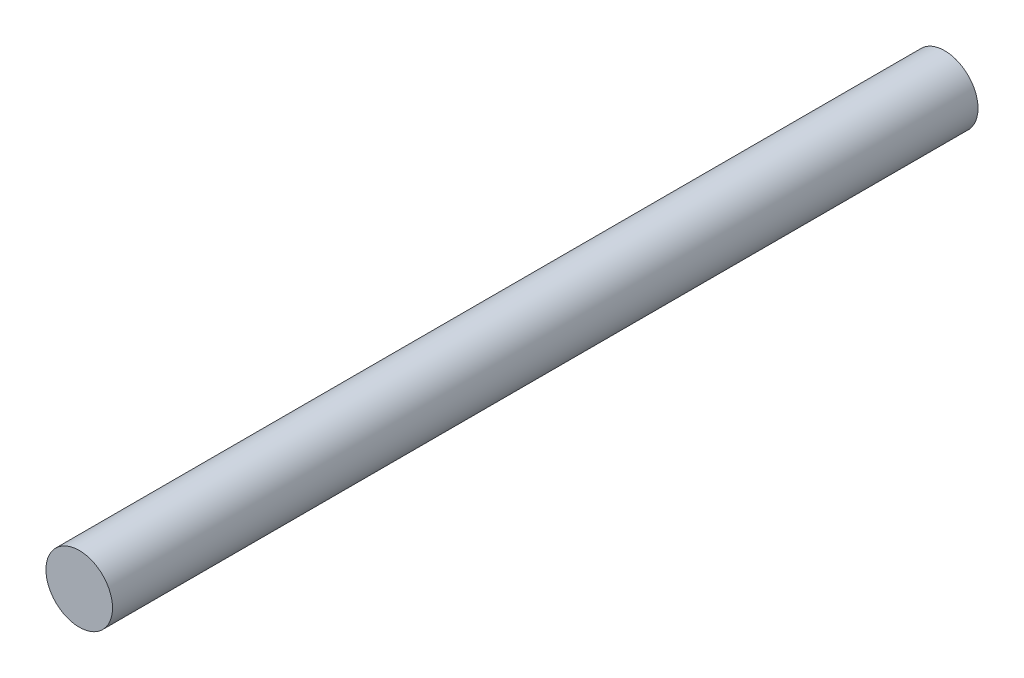
ISO-10303-21;
HEADER;
FILE_DESCRIPTION(('STEP AP214'),'2;1');
FILE_NAME('part.step','',(''),(''),'','','');
FILE_SCHEMA(('AUTOMOTIVE_DESIGN { 1 0 10303 214 1 1 1 1 }'));
ENDSEC;
DATA;
#1=APPLICATION_CONTEXT('core data for automotive mechanical design processes');
#2=APPLICATION_PROTOCOL_DEFINITION('international standard','automotive_design',2000,#1);
#3=PRODUCT_CONTEXT('',#1,'mechanical');
#4=PRODUCT('Part','Part','',(#3));
#5=PRODUCT_RELATED_PRODUCT_CATEGORY('part','',(#4));
#6=PRODUCT_DEFINITION_FORMATION('','',#4);
#7=PRODUCT_DEFINITION_CONTEXT('part definition',#1,'design');
#8=PRODUCT_DEFINITION('design','',#6,#7);
#9=PRODUCT_DEFINITION_SHAPE('','',#8);
#10=(LENGTH_UNIT() NAMED_UNIT(*) SI_UNIT(.MILLI.,.METRE.));
#11=(NAMED_UNIT(*) PLANE_ANGLE_UNIT() SI_UNIT($,.RADIAN.));
#12=(NAMED_UNIT(*) SI_UNIT($,.STERADIAN.) SOLID_ANGLE_UNIT());
#13=UNCERTAINTY_MEASURE_WITH_UNIT(LENGTH_MEASURE(1.E-05),#10,'distance_accuracy_value','');
#14=(GEOMETRIC_REPRESENTATION_CONTEXT(3) GLOBAL_UNCERTAINTY_ASSIGNED_CONTEXT((#13)) GLOBAL_UNIT_ASSIGNED_CONTEXT((#10,
#11,#12)) REPRESENTATION_CONTEXT('',''));
#15=CARTESIAN_POINT('',(0.,0.,0.));
#16=DIRECTION('',(0.,0.,1.));
#17=DIRECTION('',(1.,0.,0.));
#18=AXIS2_PLACEMENT_3D('',#15,#16,#17);
#19=CARTESIAN_POINT('',(0.,0.,165.1));
#20=DIRECTION('',(0.,0.,-1.));
#21=DIRECTION('',(-1.,0.,0.));
#22=AXIS2_PLACEMENT_3D('',#19,#20,#21);
#23=CYLINDRICAL_SURFACE('',#22,6.35);
#24=CARTESIAN_POINT('',(0.,0.,165.1));
#25=DIRECTION('',(0.,0.,1.));
#26=DIRECTION('',(1.,0.,0.));
#27=AXIS2_PLACEMENT_3D('',#24,#25,#26);
#28=CIRCLE('',#27,6.35);
#29=CARTESIAN_POINT('',(6.35,0.,165.1));
#30=VERTEX_POINT('',#29);
#31=EDGE_CURVE('E10',#30,#30,#28,.T.);
#32=ORIENTED_EDGE('',*,*,#31,.F.);
#33=EDGE_LOOP('',(#32));
#34=FACE_BOUND('',#33,.T.);
#35=CARTESIAN_POINT('',(0.,0.,0.));
#36=DIRECTION('',(0.,0.,1.));
#37=DIRECTION('',(1.,0.,0.));
#38=AXIS2_PLACEMENT_3D('',#35,#36,#37);
#39=CIRCLE('',#38,6.35);
#40=CARTESIAN_POINT('',(6.35,0.,0.));
#41=VERTEX_POINT('',#40);
#42=EDGE_CURVE('E33',#41,#41,#39,.T.);
#43=ORIENTED_EDGE('',*,*,#42,.T.);
#44=EDGE_LOOP('',(#43));
#45=FACE_BOUND('',#44,.T.);
#46=ADVANCED_FACE('F30',(#34,#45),#23,.T.);
#47=CARTESIAN_POINT('',(0.,0.,165.1));
#48=DIRECTION('',(0.,0.,1.));
#49=DIRECTION('',(1.,0.,0.));
#50=AXIS2_PLACEMENT_3D('',#47,#48,#49);
#51=PLANE('',#50);
#52=ORIENTED_EDGE('',*,*,#31,.T.);
#53=EDGE_LOOP('',(#52));
#54=FACE_BOUND('',#53,.T.);
#55=ADVANCED_FACE('F45',(#54),#51,.T.);
#56=CARTESIAN_POINT('',(0.,0.,0.));
#57=DIRECTION('',(0.,0.,1.));
#58=DIRECTION('',(1.,0.,0.));
#59=AXIS2_PLACEMENT_3D('',#56,#57,#58);
#60=PLANE('',#59);
#61=ORIENTED_EDGE('',*,*,#42,.F.);
#62=EDGE_LOOP('',(#61));
#63=FACE_BOUND('',#62,.T.);
#64=ADVANCED_FACE('F43',(#63),#60,.F.);
#65=CLOSED_SHELL('',(#46,#55,#64));
#66=MANIFOLD_SOLID_BREP('B2',#65);
#67=ADVANCED_BREP_SHAPE_REPRESENTATION('',(#18,#66),#14);
#68=SHAPE_DEFINITION_REPRESENTATION(#9,#67);
ENDSEC;
END-ISO-10303-21;
